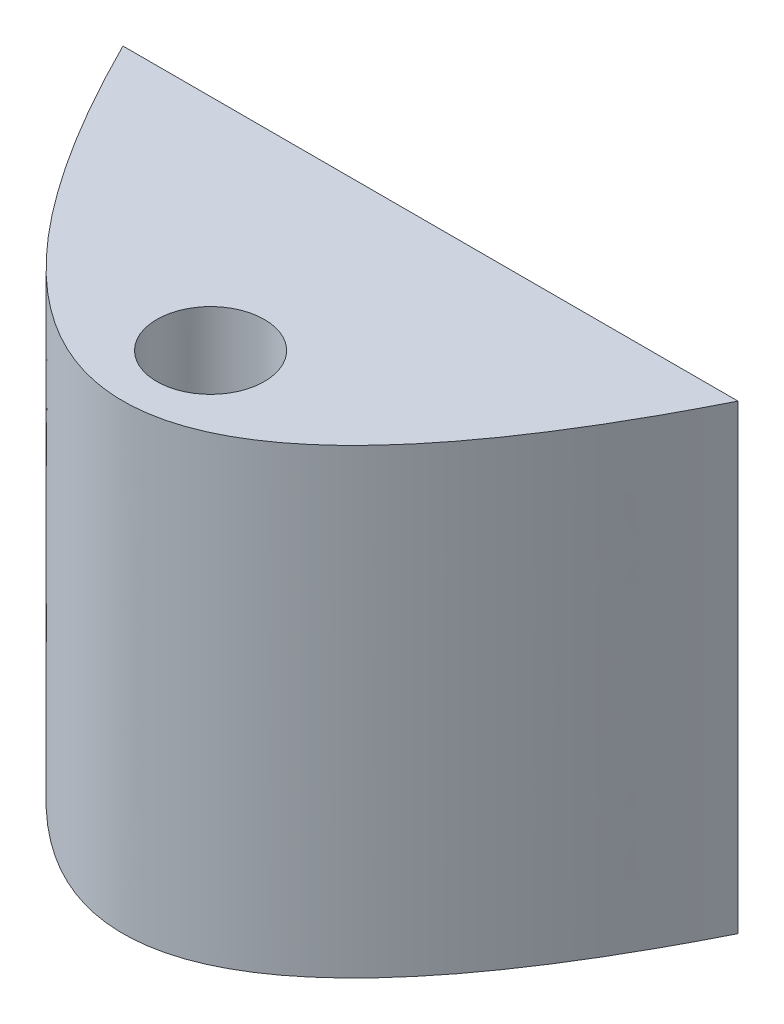
ISO-10303-21;
HEADER;
FILE_DESCRIPTION(('STEP AP214'),'2;1');
FILE_NAME('part.step','',(''),(''),'','','');
FILE_SCHEMA(('AUTOMOTIVE_DESIGN { 1 0 10303 214 1 1 1 1 }'));
ENDSEC;
DATA;
#1=APPLICATION_CONTEXT('core data for automotive mechanical design processes');
#2=APPLICATION_PROTOCOL_DEFINITION('international standard','automotive_design',2000,#1);
#3=PRODUCT_CONTEXT('',#1,'mechanical');
#4=PRODUCT('Part','Part','',(#3));
#5=PRODUCT_RELATED_PRODUCT_CATEGORY('part','',(#4));
#6=PRODUCT_DEFINITION_FORMATION('','',#4);
#7=PRODUCT_DEFINITION_CONTEXT('part definition',#1,'design');
#8=PRODUCT_DEFINITION('design','',#6,#7);
#9=PRODUCT_DEFINITION_SHAPE('','',#8);
#10=(LENGTH_UNIT() NAMED_UNIT(*) SI_UNIT(.MILLI.,.METRE.));
#11=(NAMED_UNIT(*) PLANE_ANGLE_UNIT() SI_UNIT($,.RADIAN.));
#12=(NAMED_UNIT(*) SI_UNIT($,.STERADIAN.) SOLID_ANGLE_UNIT());
#13=UNCERTAINTY_MEASURE_WITH_UNIT(LENGTH_MEASURE(1.E-05),#10,'distance_accuracy_value','');
#14=(GEOMETRIC_REPRESENTATION_CONTEXT(3) GLOBAL_UNCERTAINTY_ASSIGNED_CONTEXT((#13)) GLOBAL_UNIT_ASSIGNED_CONTEXT((#10,
#11,#12)) REPRESENTATION_CONTEXT('',''));
#15=CARTESIAN_POINT('',(0.,0.,0.));
#16=DIRECTION('',(0.,0.,1.));
#17=DIRECTION('',(1.,0.,0.));
#18=AXIS2_PLACEMENT_3D('',#15,#16,#17);
#19=CARTESIAN_POINT('',(0.,173.,142.999999999465));
#20=DIRECTION('',(0.,-1.,0.));
#21=DIRECTION('',(0.,0.,-1.));
#22=AXIS2_PLACEMENT_3D('',#19,#20,#21);
#23=CYLINDRICAL_SURFACE('',#22,15.5);
#24=CARTESIAN_POINT('',(0.,173.,142.999999999465));
#25=DIRECTION('',(0.,1.,0.));
#26=DIRECTION('',(0.,0.,1.));
#27=AXIS2_PLACEMENT_3D('',#24,#25,#26);
#28=CIRCLE('',#27,15.5);
#29=CARTESIAN_POINT('',(0.,173.,158.499999999465));
#30=VERTEX_POINT('',#29);
#31=EDGE_CURVE('E80',#30,#30,#28,.T.);
#32=ORIENTED_EDGE('',*,*,#31,.T.);
#33=EDGE_LOOP('',(#32));
#34=FACE_BOUND('',#33,.T.);
#35=CARTESIAN_POINT('',(0.,127.,142.999999999465));
#36=DIRECTION('',(0.,-1.,0.));
#37=DIRECTION('',(0.,0.,-1.));
#38=AXIS2_PLACEMENT_3D('',#35,#36,#37);
#39=CIRCLE('',#38,15.5);
#40=CARTESIAN_POINT('',(0.,127.,127.499999999465));
#41=VERTEX_POINT('',#40);
#42=EDGE_CURVE('E99',#41,#41,#39,.T.);
#43=ORIENTED_EDGE('',*,*,#42,.T.);
#44=EDGE_LOOP('',(#43));
#45=FACE_BOUND('',#44,.T.);
#46=ADVANCED_FACE('F37',(#34,#45),#23,.F.);
#47=CARTESIAN_POINT('',(0.,473.,142.999999999465));
#48=DIRECTION('',(0.,-1.,0.));
#49=DIRECTION('',(0.,0.,-1.));
#50=AXIS2_PLACEMENT_3D('',#47,#48,#49);
#51=CYLINDRICAL_SURFACE('',#50,35.);
#52=CARTESIAN_POINT('',(0.,173.,142.999999999465));
#53=DIRECTION('',(0.,1.,0.));
#54=DIRECTION('',(0.,0.,1.));
#55=AXIS2_PLACEMENT_3D('',#52,#53,#54);
#56=CIRCLE('',#55,35.);
#57=CARTESIAN_POINT('',(0.,173.,177.999999999465));
#58=VERTEX_POINT('',#57);
#59=EDGE_CURVE('E96',#58,#58,#56,.T.);
#60=ORIENTED_EDGE('',*,*,#59,.F.);
#61=EDGE_LOOP('',(#60));
#62=FACE_BOUND('',#61,.T.);
#63=CARTESIAN_POINT('',(0.,300.,142.999999999465));
#64=DIRECTION('',(0.,-1.,0.));
#65=DIRECTION('',(0.,0.,-1.));
#66=AXIS2_PLACEMENT_3D('',#63,#64,#65);
#67=CIRCLE('',#66,35.);
#68=CARTESIAN_POINT('',(0.,300.,107.999999999465));
#69=VERTEX_POINT('',#68);
#70=EDGE_CURVE('E77',#69,#69,#67,.F.);
#71=ORIENTED_EDGE('',*,*,#70,.T.);
#72=EDGE_LOOP('',(#71));
#73=FACE_BOUND('',#72,.T.);
#74=ADVANCED_FACE('F123',(#62,#73),#51,.F.);
#75=CARTESIAN_POINT('',(0.,173.,142.999999999465));
#76=DIRECTION('',(0.,1.,0.));
#77=DIRECTION('',(0.,0.,1.));
#78=AXIS2_PLACEMENT_3D('',#75,#76,#77);
#79=PLANE('',#78);
#80=ORIENTED_EDGE('',*,*,#31,.F.);
#81=EDGE_LOOP('',(#80));
#82=FACE_BOUND('',#81,.T.);
#83=ORIENTED_EDGE('',*,*,#59,.T.);
#84=EDGE_LOOP('',(#83));
#85=FACE_BOUND('',#84,.T.);
#86=ADVANCED_FACE('F129',(#82,#85),#79,.T.);
#87=CARTESIAN_POINT('',(-200.000000000337,300.,-6.70196537155832E-10));
#88=CARTESIAN_POINT('',(-5.91540705308091E-11,300.,400.000000000552));
#89=CARTESIAN_POINT('',(200.000000000219,300.,-4.34305369445553E-10));
#90=B_SPLINE_CURVE_WITH_KNOTS('',2,(#87,#88,#89),.UNSPECIFIED.,.F.,.F.,(3,3),(0.056028396232078,
0.943971603767659),.UNSPECIFIED.);
#91=DIRECTION('',(0.,-1.,0.));
#92=VECTOR('',#91,1.);
#93=SURFACE_OF_LINEAR_EXTRUSION('',#90,#92);
#94=CARTESIAN_POINT('',(-200.000000000337,0.,-6.70196537155832E-10));
#95=CARTESIAN_POINT('',(-5.91540705308091E-11,0.,400.000000000552));
#96=CARTESIAN_POINT('',(200.000000000219,0.,-4.34305369445553E-10));
#97=B_SPLINE_CURVE_WITH_KNOTS('',2,(#94,#95,#96),.UNSPECIFIED.,.F.,.F.,(3,3),(0.056028396232078,
0.943971603767659),.UNSPECIFIED.);
#98=CARTESIAN_POINT('',(-200.00000000027,0.,-5.35238059385865E-10));
#99=VERTEX_POINT('',#98);
#100=CARTESIAN_POINT('',(200.000000000156,0.,-5.35238059385865E-10));
#101=VERTEX_POINT('',#100);
#102=EDGE_CURVE('E72',#99,#101,#97,.T.);
#103=ORIENTED_EDGE('',*,*,#102,.T.);
#104=DIRECTION('',(0.,-1.,0.));
#105=VECTOR('',#104,1.);
#106=CARTESIAN_POINT('',(200.000000000156,300.,-5.35238059385865E-10));
#107=LINE('',#106,#105);
#108=CARTESIAN_POINT('',(200.000000000156,300.,-5.35238059385865E-10));
#109=VERTEX_POINT('',#108);
#110=EDGE_CURVE('E11',#109,#101,#107,.T.);
#111=ORIENTED_EDGE('',*,*,#110,.F.);
#112=CARTESIAN_POINT('',(-200.00000000027,300.,-5.35238059385865E-10));
#113=VERTEX_POINT('',#112);
#114=EDGE_CURVE('E71',#113,#109,#90,.T.);
#115=ORIENTED_EDGE('',*,*,#114,.F.);
#116=DIRECTION('',(0.,-1.,0.));
#117=VECTOR('',#116,1.);
#118=CARTESIAN_POINT('',(-200.00000000027,300.,-5.35238059385865E-10));
#119=LINE('',#118,#117);
#120=EDGE_CURVE('E48',#113,#99,#119,.T.);
#121=ORIENTED_EDGE('',*,*,#120,.T.);
#122=EDGE_LOOP('',(#103,#111,#115,#121));
#123=FACE_BOUND('',#122,.T.);
#124=ADVANCED_FACE('F39',(#123),#93,.F.);
#125=CARTESIAN_POINT('',(-200.00000000027,300.,-5.35238059385865E-10));
#126=DIRECTION('',(0.,0.,1.));
#127=DIRECTION('',(1.,0.,0.));
#128=AXIS2_PLACEMENT_3D('',#125,#126,#127);
#129=PLANE('',#128);
#130=DIRECTION('',(-1.,0.,0.));
#131=VECTOR('',#130,1.);
#132=CARTESIAN_POINT('',(-200.00000000027,0.,-5.35238059385865E-10));
#133=LINE('',#132,#131);
#134=EDGE_CURVE('E64',#101,#99,#133,.T.);
#135=ORIENTED_EDGE('',*,*,#134,.T.);
#136=ORIENTED_EDGE('',*,*,#120,.F.);
#137=DIRECTION('',(-1.,0.,0.));
#138=VECTOR('',#137,1.);
#139=CARTESIAN_POINT('',(-200.00000000027,300.,-5.35238059385865E-10));
#140=LINE('',#139,#138);
#141=EDGE_CURVE('E56',#109,#113,#140,.T.);
#142=ORIENTED_EDGE('',*,*,#141,.F.);
#143=ORIENTED_EDGE('',*,*,#110,.T.);
#144=EDGE_LOOP('',(#135,#136,#142,#143));
#145=FACE_BOUND('',#144,.T.);
#146=ADVANCED_FACE('F67',(#145),#129,.F.);
#147=CARTESIAN_POINT('',(-5.9161009424713E-11,300.,200.));
#148=DIRECTION('',(0.,-1.,0.));
#149=DIRECTION('',(0.,0.,-1.));
#150=AXIS2_PLACEMENT_3D('',#147,#148,#149);
#151=PLANE('',#150);
#152=ORIENTED_EDGE('',*,*,#70,.F.);
#153=EDGE_LOOP('',(#152));
#154=FACE_BOUND('',#153,.T.);
#155=ORIENTED_EDGE('',*,*,#114,.T.);
#156=ORIENTED_EDGE('',*,*,#141,.T.);
#157=EDGE_LOOP('',(#155,#156));
#158=FACE_BOUND('',#157,.T.);
#159=ADVANCED_FACE('F112',(#154,#158),#151,.F.);
#160=CARTESIAN_POINT('',(-5.9161009424713E-11,0.,200.));
#161=DIRECTION('',(0.,-1.,0.));
#162=DIRECTION('',(0.,0.,-1.));
#163=AXIS2_PLACEMENT_3D('',#160,#161,#162);
#164=PLANE('',#163);
#165=CARTESIAN_POINT('',(0.,0.,142.999999999465));
#166=DIRECTION('',(0.,-1.,0.));
#167=DIRECTION('',(0.,0.,-1.));
#168=AXIS2_PLACEMENT_3D('',#165,#166,#167);
#169=CIRCLE('',#168,35.);
#170=CARTESIAN_POINT('',(0.,0.,107.999999999465));
#171=VERTEX_POINT('',#170);
#172=EDGE_CURVE('E42',#171,#171,#169,.T.);
#173=ORIENTED_EDGE('',*,*,#172,.F.);
#174=EDGE_LOOP('',(#173));
#175=FACE_BOUND('',#174,.T.);
#176=ORIENTED_EDGE('',*,*,#102,.F.);
#177=ORIENTED_EDGE('',*,*,#134,.F.);
#178=EDGE_LOOP('',(#176,#177));
#179=FACE_BOUND('',#178,.T.);
#180=ADVANCED_FACE('F76',(#175,#179),#164,.T.);
#181=CARTESIAN_POINT('',(0.,-173.,142.999999999465));
#182=DIRECTION('',(0.,1.,0.));
#183=DIRECTION('',(0.,0.,1.));
#184=AXIS2_PLACEMENT_3D('',#181,#182,#183);
#185=CYLINDRICAL_SURFACE('',#184,35.);
#186=ORIENTED_EDGE('',*,*,#172,.T.);
#187=EDGE_LOOP('',(#186));
#188=FACE_BOUND('',#187,.T.);
#189=CARTESIAN_POINT('',(0.,127.,142.999999999465));
#190=DIRECTION('',(0.,1.,0.));
#191=DIRECTION('',(0.,0.,1.));
#192=AXIS2_PLACEMENT_3D('',#189,#190,#191);
#193=CIRCLE('',#192,35.);
#194=CARTESIAN_POINT('',(0.,127.,177.999999999465));
#195=VERTEX_POINT('',#194);
#196=EDGE_CURVE('E102',#195,#195,#193,.T.);
#197=ORIENTED_EDGE('',*,*,#196,.T.);
#198=EDGE_LOOP('',(#197));
#199=FACE_BOUND('',#198,.T.);
#200=ADVANCED_FACE('F109',(#188,#199),#185,.F.);
#201=CARTESIAN_POINT('',(0.,127.,142.999999999465));
#202=DIRECTION('',(0.,-1.,0.));
#203=DIRECTION('',(0.,0.,1.));
#204=AXIS2_PLACEMENT_3D('',#201,#202,#203);
#205=PLANE('',#204);
#206=ORIENTED_EDGE('',*,*,#42,.F.);
#207=EDGE_LOOP('',(#206));
#208=FACE_BOUND('',#207,.T.);
#209=ORIENTED_EDGE('',*,*,#196,.F.);
#210=EDGE_LOOP('',(#209));
#211=FACE_BOUND('',#210,.T.);
#212=ADVANCED_FACE('F118',(#208,#211),#205,.T.);
#213=CLOSED_SHELL('',(#46,#74,#86,#124,#146,#159,#180,#200,#212));
#214=MANIFOLD_SOLID_BREP('B2',#213);
#215=ADVANCED_BREP_SHAPE_REPRESENTATION('',(#18,#214),#14);
#216=SHAPE_DEFINITION_REPRESENTATION(#9,#215);
ENDSEC;
END-ISO-10303-21;
